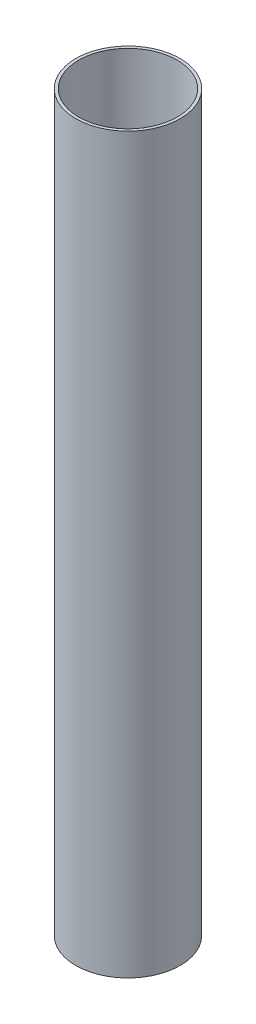
ISO-10303-21;
HEADER;
FILE_DESCRIPTION(('STEP AP214'),'2;1');
FILE_NAME('part.step','',(''),(''),'','','');
FILE_SCHEMA(('AUTOMOTIVE_DESIGN { 1 0 10303 214 1 1 1 1 }'));
ENDSEC;
DATA;
#1=APPLICATION_CONTEXT('core data for automotive mechanical design processes');
#2=APPLICATION_PROTOCOL_DEFINITION('international standard','automotive_design',2000,#1);
#3=PRODUCT_CONTEXT('',#1,'mechanical');
#4=PRODUCT('Part','Part','',(#3));
#5=PRODUCT_RELATED_PRODUCT_CATEGORY('part','',(#4));
#6=PRODUCT_DEFINITION_FORMATION('','',#4);
#7=PRODUCT_DEFINITION_CONTEXT('part definition',#1,'design');
#8=PRODUCT_DEFINITION('design','',#6,#7);
#9=PRODUCT_DEFINITION_SHAPE('','',#8);
#10=(LENGTH_UNIT() NAMED_UNIT(*) SI_UNIT(.MILLI.,.METRE.));
#11=(NAMED_UNIT(*) PLANE_ANGLE_UNIT() SI_UNIT($,.RADIAN.));
#12=(NAMED_UNIT(*) SI_UNIT($,.STERADIAN.) SOLID_ANGLE_UNIT());
#13=UNCERTAINTY_MEASURE_WITH_UNIT(LENGTH_MEASURE(1.E-05),#10,'distance_accuracy_value','');
#14=(GEOMETRIC_REPRESENTATION_CONTEXT(3) GLOBAL_UNCERTAINTY_ASSIGNED_CONTEXT((#13)) GLOBAL_UNIT_ASSIGNED_CONTEXT((#10,
#11,#12)) REPRESENTATION_CONTEXT('',''));
#15=CARTESIAN_POINT('',(0.,0.,0.));
#16=DIRECTION('',(0.,0.,1.));
#17=DIRECTION('',(1.,0.,0.));
#18=AXIS2_PLACEMENT_3D('',#15,#16,#17);
#19=CARTESIAN_POINT('',(0.,406.4,0.));
#20=DIRECTION('',(0.,1.,0.));
#21=DIRECTION('',(0.,0.,1.));
#22=AXIS2_PLACEMENT_3D('',#19,#20,#21);
#23=PLANE('',#22);
#24=CARTESIAN_POINT('',(0.,406.4,0.));
#25=DIRECTION('',(0.,1.,0.));
#26=DIRECTION('',(0.,0.,1.));
#27=AXIS2_PLACEMENT_3D('',#24,#25,#26);
#28=CIRCLE('',#27,28.9052);
#29=CARTESIAN_POINT('',(0.,406.4,28.9052));
#30=VERTEX_POINT('',#29);
#31=EDGE_CURVE('E10',#30,#30,#28,.T.);
#32=ORIENTED_EDGE('',*,*,#31,.T.);
#33=EDGE_LOOP('',(#32));
#34=FACE_BOUND('',#33,.T.);
#35=CARTESIAN_POINT('',(0.,406.4,0.));
#36=DIRECTION('',(0.,1.,0.));
#37=DIRECTION('',(0.,0.,1.));
#38=AXIS2_PLACEMENT_3D('',#35,#36,#37);
#39=CIRCLE('',#38,27.3304);
#40=CARTESIAN_POINT('',(0.,406.4,27.3304));
#41=VERTEX_POINT('',#40);
#42=EDGE_CURVE('E49',#41,#41,#39,.T.);
#43=ORIENTED_EDGE('',*,*,#42,.F.);
#44=EDGE_LOOP('',(#43));
#45=FACE_BOUND('',#44,.T.);
#46=ADVANCED_FACE('F38',(#34,#45),#23,.T.);
#47=CARTESIAN_POINT('',(0.,0.,0.));
#48=DIRECTION('',(0.,1.,0.));
#49=DIRECTION('',(0.,0.,1.));
#50=AXIS2_PLACEMENT_3D('',#47,#48,#49);
#51=PLANE('',#50);
#52=CARTESIAN_POINT('',(0.,0.,0.));
#53=DIRECTION('',(0.,1.,0.));
#54=DIRECTION('',(0.,0.,1.));
#55=AXIS2_PLACEMENT_3D('',#52,#53,#54);
#56=CIRCLE('',#55,28.9052);
#57=CARTESIAN_POINT('',(0.,0.,28.9052));
#58=VERTEX_POINT('',#57);
#59=EDGE_CURVE('E42',#58,#58,#56,.T.);
#60=ORIENTED_EDGE('',*,*,#59,.F.);
#61=EDGE_LOOP('',(#60));
#62=FACE_BOUND('',#61,.T.);
#63=CARTESIAN_POINT('',(0.,0.,0.));
#64=DIRECTION('',(0.,1.,0.));
#65=DIRECTION('',(0.,0.,1.));
#66=AXIS2_PLACEMENT_3D('',#63,#64,#65);
#67=CIRCLE('',#66,27.3304);
#68=CARTESIAN_POINT('',(0.,0.,27.3304));
#69=VERTEX_POINT('',#68);
#70=EDGE_CURVE('E51',#69,#69,#67,.T.);
#71=ORIENTED_EDGE('',*,*,#70,.T.);
#72=EDGE_LOOP('',(#71));
#73=FACE_BOUND('',#72,.T.);
#74=ADVANCED_FACE('F61',(#62,#73),#51,.F.);
#75=CARTESIAN_POINT('',(0.,406.4,0.));
#76=DIRECTION('',(0.,-1.,0.));
#77=DIRECTION('',(0.,0.,-1.));
#78=AXIS2_PLACEMENT_3D('',#75,#76,#77);
#79=CYLINDRICAL_SURFACE('',#78,28.9052);
#80=ORIENTED_EDGE('',*,*,#31,.F.);
#81=EDGE_LOOP('',(#80));
#82=FACE_BOUND('',#81,.T.);
#83=ORIENTED_EDGE('',*,*,#59,.T.);
#84=EDGE_LOOP('',(#83));
#85=FACE_BOUND('',#84,.T.);
#86=ADVANCED_FACE('F40',(#82,#85),#79,.T.);
#87=CARTESIAN_POINT('',(0.,406.4,0.));
#88=DIRECTION('',(0.,-1.,0.));
#89=DIRECTION('',(0.,0.,-1.));
#90=AXIS2_PLACEMENT_3D('',#87,#88,#89);
#91=CYLINDRICAL_SURFACE('',#90,27.3304);
#92=ORIENTED_EDGE('',*,*,#42,.T.);
#93=EDGE_LOOP('',(#92));
#94=FACE_BOUND('',#93,.T.);
#95=ORIENTED_EDGE('',*,*,#70,.F.);
#96=EDGE_LOOP('',(#95));
#97=FACE_BOUND('',#96,.T.);
#98=ADVANCED_FACE('F57',(#94,#97),#91,.F.);
#99=CLOSED_SHELL('',(#46,#74,#86,#98));
#100=MANIFOLD_SOLID_BREP('B2',#99);
#101=ADVANCED_BREP_SHAPE_REPRESENTATION('',(#18,#100),#14);
#102=SHAPE_DEFINITION_REPRESENTATION(#9,#101);
ENDSEC;
END-ISO-10303-21;
